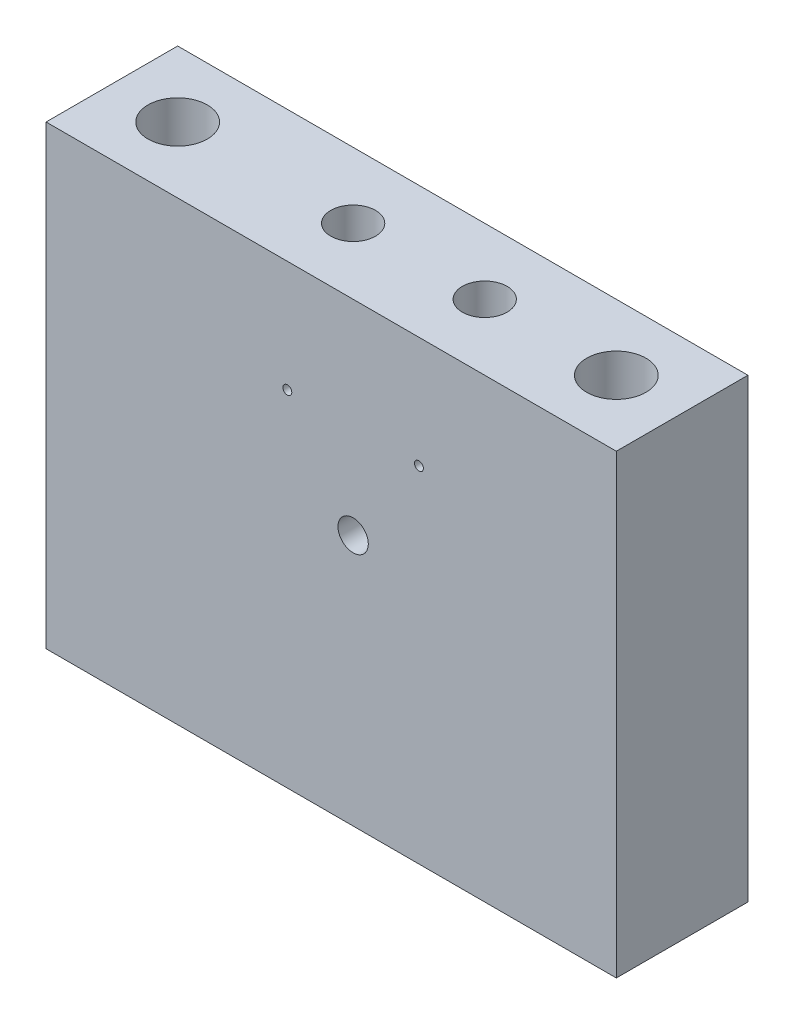
ISO-10303-21;
HEADER;
FILE_DESCRIPTION(('STEP AP214'),'2;1');
FILE_NAME('part.step','',(''),(''),'','','');
FILE_SCHEMA(('AUTOMOTIVE_DESIGN { 1 0 10303 214 1 1 1 1 }'));
ENDSEC;
DATA;
#1=APPLICATION_CONTEXT('core data for automotive mechanical design processes');
#2=APPLICATION_PROTOCOL_DEFINITION('international standard','automotive_design',2000,#1);
#3=PRODUCT_CONTEXT('',#1,'mechanical');
#4=PRODUCT('Part','Part','',(#3));
#5=PRODUCT_RELATED_PRODUCT_CATEGORY('part','',(#4));
#6=PRODUCT_DEFINITION_FORMATION('','',#4);
#7=PRODUCT_DEFINITION_CONTEXT('part definition',#1,'design');
#8=PRODUCT_DEFINITION('design','',#6,#7);
#9=PRODUCT_DEFINITION_SHAPE('','',#8);
#10=(LENGTH_UNIT() NAMED_UNIT(*) SI_UNIT(.MILLI.,.METRE.));
#11=(NAMED_UNIT(*) PLANE_ANGLE_UNIT() SI_UNIT($,.RADIAN.));
#12=(NAMED_UNIT(*) SI_UNIT($,.STERADIAN.) SOLID_ANGLE_UNIT());
#13=UNCERTAINTY_MEASURE_WITH_UNIT(LENGTH_MEASURE(1.E-05),#10,'distance_accuracy_value','');
#14=(GEOMETRIC_REPRESENTATION_CONTEXT(3) GLOBAL_UNCERTAINTY_ASSIGNED_CONTEXT((#13)) GLOBAL_UNIT_ASSIGNED_CONTEXT((#10,
#11,#12)) REPRESENTATION_CONTEXT('',''));
#15=CARTESIAN_POINT('',(0.,0.,0.));
#16=DIRECTION('',(0.,0.,1.));
#17=DIRECTION('',(1.,0.,0.));
#18=AXIS2_PLACEMENT_3D('',#15,#16,#17);
#19=CARTESIAN_POINT('',(32.5,26.,7.50000000000001));
#20=DIRECTION('',(0.,-1.,0.));
#21=DIRECTION('',(0.,0.,-1.));
#22=AXIS2_PLACEMENT_3D('',#19,#20,#21);
#23=PLANE('',#22);
#24=CARTESIAN_POINT('',(25.,26.,0.));
#25=DIRECTION('',(0.,1.,0.));
#26=DIRECTION('',(0.,0.,1.));
#27=AXIS2_PLACEMENT_3D('',#24,#25,#26);
#28=CIRCLE('',#27,3.37819999999999);
#29=CARTESIAN_POINT('',(25.,26.,3.37819999999999));
#30=VERTEX_POINT('',#29);
#31=EDGE_CURVE('E212',#30,#30,#28,.T.);
#32=ORIENTED_EDGE('',*,*,#31,.F.);
#33=EDGE_LOOP('',(#32));
#34=FACE_BOUND('',#33,.T.);
#35=CARTESIAN_POINT('',(-25.,26.,0.));
#36=DIRECTION('',(0.,1.,0.));
#37=DIRECTION('',(0.,0.,1.));
#38=AXIS2_PLACEMENT_3D('',#35,#36,#37);
#39=CIRCLE('',#38,3.37819999999999);
#40=CARTESIAN_POINT('',(-25.,26.,3.37819999999999));
#41=VERTEX_POINT('',#40);
#42=EDGE_CURVE('E92',#41,#41,#39,.T.);
#43=ORIENTED_EDGE('',*,*,#42,.F.);
#44=EDGE_LOOP('',(#43));
#45=FACE_BOUND('',#44,.T.);
#46=CARTESIAN_POINT('',(-5.,26.,0.));
#47=DIRECTION('',(0.,1.,0.));
#48=DIRECTION('',(0.,0.,1.));
#49=AXIS2_PLACEMENT_3D('',#46,#47,#48);
#50=CIRCLE('',#49,2.5527);
#51=CARTESIAN_POINT('',(-5.,26.,2.5527));
#52=VERTEX_POINT('',#51);
#53=EDGE_CURVE('E91',#52,#52,#50,.T.);
#54=ORIENTED_EDGE('',*,*,#53,.F.);
#55=EDGE_LOOP('',(#54));
#56=FACE_BOUND('',#55,.T.);
#57=CARTESIAN_POINT('',(10.,26.,0.));
#58=DIRECTION('',(0.,1.,0.));
#59=DIRECTION('',(0.,0.,1.));
#60=AXIS2_PLACEMENT_3D('',#57,#58,#59);
#61=CIRCLE('',#60,2.5527);
#62=CARTESIAN_POINT('',(10.,26.,2.5527));
#63=VERTEX_POINT('',#62);
#64=EDGE_CURVE('E104',#63,#63,#61,.T.);
#65=ORIENTED_EDGE('',*,*,#64,.F.);
#66=EDGE_LOOP('',(#65));
#67=FACE_BOUND('',#66,.T.);
#68=DIRECTION('',(-1.,0.,0.));
#69=VECTOR('',#68,1.);
#70=CARTESIAN_POINT('',(32.5,26.,-7.50000000000001));
#71=LINE('',#70,#69);
#72=CARTESIAN_POINT('',(32.5,26.,-7.50000000000001));
#73=VERTEX_POINT('',#72);
#74=CARTESIAN_POINT('',(-32.5,26.,-7.50000000000001));
#75=VERTEX_POINT('',#74);
#76=EDGE_CURVE('E107',#73,#75,#71,.T.);
#77=ORIENTED_EDGE('',*,*,#76,.T.);
#78=DIRECTION('',(0.,0.,-1.));
#79=VECTOR('',#78,1.);
#80=CARTESIAN_POINT('',(-32.5,26.,7.50000000000001));
#81=LINE('',#80,#79);
#82=CARTESIAN_POINT('',(-32.5,26.,7.50000000000001));
#83=VERTEX_POINT('',#82);
#84=EDGE_CURVE('E11',#83,#75,#81,.T.);
#85=ORIENTED_EDGE('',*,*,#84,.F.);
#86=DIRECTION('',(-1.,0.,0.));
#87=VECTOR('',#86,1.);
#88=CARTESIAN_POINT('',(32.5,26.,7.50000000000001));
#89=LINE('',#88,#87);
#90=CARTESIAN_POINT('',(32.5,26.,7.50000000000001));
#91=VERTEX_POINT('',#90);
#92=EDGE_CURVE('E116',#91,#83,#89,.T.);
#93=ORIENTED_EDGE('',*,*,#92,.F.);
#94=DIRECTION('',(0.,0.,-1.));
#95=VECTOR('',#94,1.);
#96=CARTESIAN_POINT('',(32.5,26.,7.50000000000001));
#97=LINE('',#96,#95);
#98=EDGE_CURVE('E122',#91,#73,#97,.T.);
#99=ORIENTED_EDGE('',*,*,#98,.T.);
#100=EDGE_LOOP('',(#77,#85,#93,#99));
#101=FACE_BOUND('',#100,.T.);
#102=ADVANCED_FACE('F37',(#34,#45,#56,#67,#101),#23,.F.);
#103=CARTESIAN_POINT('',(-32.4999999999999,-26.,7.50000000000001));
#104=DIRECTION('',(1.,0.,0.));
#105=DIRECTION('',(0.,0.,-1.));
#106=AXIS2_PLACEMENT_3D('',#103,#104,#105);
#107=PLANE('',#106);
#108=DIRECTION('',(0.,-1.,0.));
#109=VECTOR('',#108,1.);
#110=CARTESIAN_POINT('',(-32.4999999999999,-26.,-7.50000000000001));
#111=LINE('',#110,#109);
#112=CARTESIAN_POINT('',(-32.4999999999999,-26.,-7.50000000000001));
#113=VERTEX_POINT('',#112);
#114=EDGE_CURVE('E110',#75,#113,#111,.T.);
#115=ORIENTED_EDGE('',*,*,#114,.T.);
#116=DIRECTION('',(0.,0.,-1.));
#117=VECTOR('',#116,1.);
#118=CARTESIAN_POINT('',(-32.4999999999999,-26.,7.50000000000001));
#119=LINE('',#118,#117);
#120=CARTESIAN_POINT('',(-32.4999999999999,-26.,7.50000000000001));
#121=VERTEX_POINT('',#120);
#122=EDGE_CURVE('E44',#121,#113,#119,.T.);
#123=ORIENTED_EDGE('',*,*,#122,.F.);
#124=DIRECTION('',(0.,-1.,0.));
#125=VECTOR('',#124,1.);
#126=CARTESIAN_POINT('',(-32.4999999999999,-26.,7.50000000000001));
#127=LINE('',#126,#125);
#128=EDGE_CURVE('E118',#83,#121,#127,.T.);
#129=ORIENTED_EDGE('',*,*,#128,.F.);
#130=ORIENTED_EDGE('',*,*,#84,.T.);
#131=EDGE_LOOP('',(#115,#123,#129,#130));
#132=FACE_BOUND('',#131,.T.);
#133=ADVANCED_FACE('F143',(#132),#107,.F.);
#134=CARTESIAN_POINT('',(32.5,-26.,7.50000000000001));
#135=DIRECTION('',(0.,1.,0.));
#136=DIRECTION('',(0.,0.,1.));
#137=AXIS2_PLACEMENT_3D('',#134,#135,#136);
#138=PLANE('',#137);
#139=CARTESIAN_POINT('',(25.,-26.,0.));
#140=DIRECTION('',(0.,1.,0.));
#141=DIRECTION('',(0.,0.,1.));
#142=AXIS2_PLACEMENT_3D('',#139,#140,#141);
#143=CIRCLE('',#142,3.37819999999999);
#144=CARTESIAN_POINT('',(25.,-26.,3.37819999999999));
#145=VERTEX_POINT('',#144);
#146=EDGE_CURVE('E209',#145,#145,#143,.T.);
#147=ORIENTED_EDGE('',*,*,#146,.T.);
#148=EDGE_LOOP('',(#147));
#149=FACE_BOUND('',#148,.T.);
#150=CARTESIAN_POINT('',(-25.,-26.,0.));
#151=DIRECTION('',(0.,1.,0.));
#152=DIRECTION('',(0.,0.,1.));
#153=AXIS2_PLACEMENT_3D('',#150,#151,#152);
#154=CIRCLE('',#153,3.37819999999999);
#155=CARTESIAN_POINT('',(-25.,-26.,3.37819999999999));
#156=VERTEX_POINT('',#155);
#157=EDGE_CURVE('E98',#156,#156,#154,.T.);
#158=ORIENTED_EDGE('',*,*,#157,.T.);
#159=EDGE_LOOP('',(#158));
#160=FACE_BOUND('',#159,.T.);
#161=DIRECTION('',(1.,0.,0.));
#162=VECTOR('',#161,1.);
#163=CARTESIAN_POINT('',(32.5,-26.,-7.50000000000001));
#164=LINE('',#163,#162);
#165=CARTESIAN_POINT('',(32.5,-26.,-7.50000000000001));
#166=VERTEX_POINT('',#165);
#167=EDGE_CURVE('E112',#113,#166,#164,.T.);
#168=ORIENTED_EDGE('',*,*,#167,.T.);
#169=DIRECTION('',(0.,0.,-1.));
#170=VECTOR('',#169,1.);
#171=CARTESIAN_POINT('',(32.5,-26.,7.50000000000001));
#172=LINE('',#171,#170);
#173=CARTESIAN_POINT('',(32.5,-26.,7.50000000000001));
#174=VERTEX_POINT('',#173);
#175=EDGE_CURVE('E125',#174,#166,#172,.T.);
#176=ORIENTED_EDGE('',*,*,#175,.F.);
#177=DIRECTION('',(1.,0.,0.));
#178=VECTOR('',#177,1.);
#179=CARTESIAN_POINT('',(32.5,-26.,7.50000000000001));
#180=LINE('',#179,#178);
#181=EDGE_CURVE('E56',#121,#174,#180,.T.);
#182=ORIENTED_EDGE('',*,*,#181,.F.);
#183=ORIENTED_EDGE('',*,*,#122,.T.);
#184=EDGE_LOOP('',(#168,#176,#182,#183));
#185=FACE_BOUND('',#184,.T.);
#186=ADVANCED_FACE('F131',(#149,#160,#185),#138,.F.);
#187=CARTESIAN_POINT('',(32.5,-26.,7.50000000000001));
#188=DIRECTION('',(-1.,0.,0.));
#189=DIRECTION('',(0.,0.,1.));
#190=AXIS2_PLACEMENT_3D('',#187,#188,#189);
#191=PLANE('',#190);
#192=DIRECTION('',(0.,1.,0.));
#193=VECTOR('',#192,1.);
#194=CARTESIAN_POINT('',(32.5,-26.,-7.50000000000001));
#195=LINE('',#194,#193);
#196=EDGE_CURVE('E114',#166,#73,#195,.T.);
#197=ORIENTED_EDGE('',*,*,#196,.T.);
#198=ORIENTED_EDGE('',*,*,#98,.F.);
#199=DIRECTION('',(0.,1.,0.));
#200=VECTOR('',#199,1.);
#201=CARTESIAN_POINT('',(32.5,-26.,7.50000000000001));
#202=LINE('',#201,#200);
#203=EDGE_CURVE('E51',#174,#91,#202,.T.);
#204=ORIENTED_EDGE('',*,*,#203,.F.);
#205=ORIENTED_EDGE('',*,*,#175,.T.);
#206=EDGE_LOOP('',(#197,#198,#204,#205));
#207=FACE_BOUND('',#206,.T.);
#208=ADVANCED_FACE('F138',(#207),#191,.F.);
#209=CARTESIAN_POINT('',(-32.5,26.,7.50000000000001));
#210=DIRECTION('',(0.,0.,-1.));
#211=DIRECTION('',(-1.,0.,0.));
#212=AXIS2_PLACEMENT_3D('',#209,#210,#211);
#213=PLANE('',#212);
#214=CARTESIAN_POINT('',(-5.,13.3,7.50000000000001));
#215=DIRECTION('',(0.,0.,1.));
#216=DIRECTION('',(1.,0.,0.));
#217=AXIS2_PLACEMENT_3D('',#214,#215,#216);
#218=CIRCLE('',#217,0.508);
#219=CARTESIAN_POINT('',(-4.492,13.3,7.50000000000001));
#220=VERTEX_POINT('',#219);
#221=EDGE_CURVE('E199',#220,#220,#218,.T.);
#222=ORIENTED_EDGE('',*,*,#221,.F.);
#223=EDGE_LOOP('',(#222));
#224=FACE_BOUND('',#223,.T.);
#225=CARTESIAN_POINT('',(9.99999999999999,13.3,7.50000000000001));
#226=DIRECTION('',(0.,0.,1.));
#227=DIRECTION('',(1.,0.,0.));
#228=AXIS2_PLACEMENT_3D('',#225,#226,#227);
#229=CIRCLE('',#228,0.508);
#230=CARTESIAN_POINT('',(10.508,13.3,7.50000000000001));
#231=VERTEX_POINT('',#230);
#232=EDGE_CURVE('E198',#231,#231,#229,.T.);
#233=ORIENTED_EDGE('',*,*,#232,.F.);
#234=EDGE_LOOP('',(#233));
#235=FACE_BOUND('',#234,.T.);
#236=CARTESIAN_POINT('',(2.50000000000001,2.69999999999998,7.50000000000001));
#237=DIRECTION('',(0.,0.,-1.));
#238=DIRECTION('',(-1.,0.,0.));
#239=AXIS2_PLACEMENT_3D('',#236,#237,#238);
#240=CIRCLE('',#239,1.7272);
#241=CARTESIAN_POINT('',(0.772800000000009,2.69999999999998,7.50000000000001));
#242=VERTEX_POINT('',#241);
#243=EDGE_CURVE('E203',#242,#242,#240,.T.);
#244=ORIENTED_EDGE('',*,*,#243,.T.);
#245=EDGE_LOOP('',(#244));
#246=FACE_BOUND('',#245,.T.);
#247=ORIENTED_EDGE('',*,*,#92,.T.);
#248=ORIENTED_EDGE('',*,*,#128,.T.);
#249=ORIENTED_EDGE('',*,*,#181,.T.);
#250=ORIENTED_EDGE('',*,*,#203,.T.);
#251=EDGE_LOOP('',(#247,#248,#249,#250));
#252=FACE_BOUND('',#251,.T.);
#253=ADVANCED_FACE('F142',(#224,#235,#246,#252),#213,.F.);
#254=CARTESIAN_POINT('',(-32.5,26.,-7.50000000000001));
#255=DIRECTION('',(0.,0.,-1.));
#256=DIRECTION('',(-1.,0.,0.));
#257=AXIS2_PLACEMENT_3D('',#254,#255,#256);
#258=PLANE('',#257);
#259=CARTESIAN_POINT('',(2.50000000000001,2.7,-7.50000000000001));
#260=DIRECTION('',(0.,0.,-1.));
#261=DIRECTION('',(-1.,0.,0.));
#262=AXIS2_PLACEMENT_3D('',#259,#260,#261);
#263=CIRCLE('',#262,1.72719999999999);
#264=CARTESIAN_POINT('',(0.772800000000017,2.7,-7.50000000000001));
#265=VERTEX_POINT('',#264);
#266=EDGE_CURVE('E206',#265,#265,#263,.T.);
#267=ORIENTED_EDGE('',*,*,#266,.F.);
#268=EDGE_LOOP('',(#267));
#269=FACE_BOUND('',#268,.T.);
#270=ORIENTED_EDGE('',*,*,#76,.F.);
#271=ORIENTED_EDGE('',*,*,#196,.F.);
#272=ORIENTED_EDGE('',*,*,#167,.F.);
#273=ORIENTED_EDGE('',*,*,#114,.F.);
#274=EDGE_LOOP('',(#270,#271,#272,#273));
#275=FACE_BOUND('',#274,.T.);
#276=ADVANCED_FACE('F136',(#269,#275),#258,.T.);
#277=CARTESIAN_POINT('',(10.,26.,0.));
#278=DIRECTION('',(0.,1.,0.));
#279=DIRECTION('',(0.,0.,1.));
#280=AXIS2_PLACEMENT_3D('',#277,#278,#279);
#281=CYLINDRICAL_SURFACE('',#280,2.5527);
#282=CARTESIAN_POINT('',(10.508,13.3,2.50164211868925));
#283=CARTESIAN_POINT('',(10.5079989530176,13.2717702238329,2.50164267906969));
#284=CARTESIAN_POINT('',(10.5056388977889,13.2435272288031,2.50212515210422));
#285=CARTESIAN_POINT('',(10.4962687781845,13.1878400030869,2.50400011355603));
#286=CARTESIAN_POINT('',(10.4892549747657,13.1603964332203,2.50539333369765));
#287=CARTESIAN_POINT('',(10.4708032834085,13.1071217748594,2.5089258924916));
#288=CARTESIAN_POINT('',(10.4593697728961,13.0812891201685,2.51106449268909));
#289=CARTESIAN_POINT('',(10.4324151740925,13.0319094744302,2.51584596688065));
#290=CARTESIAN_POINT('',(10.4168943213309,13.0083623517878,2.51848881181562));
#291=CARTESIAN_POINT('',(10.381973953277,12.963891200309,2.52402233512416));
#292=CARTESIAN_POINT('',(10.3625281713907,12.9430038313108,2.52691570931868));
#293=CARTESIAN_POINT('',(10.3204099033376,12.9047650964141,2.53260054684003));
#294=CARTESIAN_POINT('',(10.2977371923734,12.8874139770662,2.53539200304991));
#295=CARTESIAN_POINT('',(10.2495660612439,12.8565981688786,2.54058754142937));
#296=CARTESIAN_POINT('',(10.224044953829,12.8431682949505,2.54298807445595));
#297=CARTESIAN_POINT('',(10.1710527550834,12.82080082925,2.54710101717758));
#298=CARTESIAN_POINT('',(10.1435818447258,12.8118628211813,2.54881349063756));
#299=CARTESIAN_POINT('',(10.0878502429101,12.7988468623857,2.55133831997524));
#300=CARTESIAN_POINT('',(10.0596045345752,12.7947070158637,2.55216212967878));
#301=CARTESIAN_POINT('',(10.0028082828865,12.7912118038326,2.55285636199083));
#302=CARTESIAN_POINT('',(9.97425776888728,12.7918559816707,2.55272687559498));
#303=CARTESIAN_POINT('',(9.91808760036911,12.7978635439566,2.55153798681053));
#304=CARTESIAN_POINT('',(9.89046049684028,12.80316025881,2.55049172212096));
#305=CARTESIAN_POINT('',(9.83649523078351,12.8182168182359,2.54760164554639));
#306=CARTESIAN_POINT('',(9.81015711950989,12.827976840124,2.54575780197581));
#307=CARTESIAN_POINT('',(9.75932702568952,12.8517448703033,2.5414580665094));
#308=CARTESIAN_POINT('',(9.73484760733492,12.8657790416731,2.53899842213402));
#309=CARTESIAN_POINT('',(9.68856651478097,12.897677638786,2.5337383033244));
#310=CARTESIAN_POINT('',(9.66676514623332,12.9155425010966,2.53093779005851));
#311=CARTESIAN_POINT('',(9.6260634196296,12.9549612381289,2.52524830949609));
#312=CARTESIAN_POINT('',(9.60721962162856,12.9765734579301,2.52235864976327));
#313=CARTESIAN_POINT('',(9.57341475090448,13.0226803656145,2.51686243379785));
#314=CARTESIAN_POINT('',(9.55845375017027,13.0471751069287,2.51425588281472));
#315=CARTESIAN_POINT('',(9.53281993108517,13.0984324628304,2.50961967714141));
#316=CARTESIAN_POINT('',(9.52215619236394,13.1251997361436,2.50759124657248));
#317=CARTESIAN_POINT('',(9.50549398182397,13.1801957555636,2.50435897045997));
#318=CARTESIAN_POINT('',(9.49949490854747,13.2084243127529,2.50315501861125));
#319=CARTESIAN_POINT('',(9.49241669399007,13.2650291804625,2.50172928989284));
#320=CARTESIAN_POINT('',(9.49125590946148,13.2933948825294,2.50149121625503));
#321=CARTESIAN_POINT('',(9.49366759782454,13.3499146308433,2.50198046613944));
#322=CARTESIAN_POINT('',(9.49723980515025,13.3780686888764,2.50270773549672));
#323=CARTESIAN_POINT('',(9.50894571455685,13.4330920255943,2.5050304718299));
#324=CARTESIAN_POINT('',(9.51703586053722,13.4599709524883,2.50661764443859));
#325=CARTESIAN_POINT('',(9.53750145449165,13.5119918297282,2.51047409004396));
#326=CARTESIAN_POINT('',(9.54987725248474,13.5371336379984,2.5127434187519));
#327=CARTESIAN_POINT('',(9.5787479127634,13.5853240422823,2.51774513327542));
#328=CARTESIAN_POINT('',(9.59529390100952,13.608341416294,2.5204831201568));
#329=CARTESIAN_POINT('',(9.63196704695092,13.6513026979706,2.52609824920598));
#330=CARTESIAN_POINT('',(9.65209456939174,13.6712462922134,2.52897540552512));
#331=CARTESIAN_POINT('',(9.69572579516931,13.7078030662126,2.5345975389888));
#332=CARTESIAN_POINT('',(9.71927612958817,13.7243610680217,2.53733984517944));
#333=CARTESIAN_POINT('',(9.7688716998817,13.753285418631,2.54233696696414));
#334=CARTESIAN_POINT('',(9.7949168315973,13.7656519423297,2.54459180289754));
#335=CARTESIAN_POINT('',(9.84861701352699,13.7857616945684,2.548348514013));
#336=CARTESIAN_POINT('',(9.87626200123963,13.793530967532,2.54985462297054));
#337=CARTESIAN_POINT('',(9.93249756361881,13.8043082459782,2.55196233338833));
#338=CARTESIAN_POINT('',(9.96108802516623,13.8073168189552,2.55256404265618));
#339=CARTESIAN_POINT('',(10.0178757406504,13.8084654983939,2.55279264142016));
#340=CARTESIAN_POINT('',(10.0460712820222,13.8066885937506,2.55243614810555));
#341=CARTESIAN_POINT('',(10.101753416474,13.7984998754009,2.55082330233805));
#342=CARTESIAN_POINT('',(10.1292400182829,13.7920881187905,2.54956696097022));
#343=CARTESIAN_POINT('',(10.18267296273,13.7748484332183,2.54629601333399));
#344=CARTESIAN_POINT('',(10.208622603104,13.764030383096,2.54428310405324));
#345=CARTESIAN_POINT('',(10.2583503593043,13.7382956402495,2.53971585471301));
#346=CARTESIAN_POINT('',(10.2821283054213,13.7233786275721,2.53716147239127));
#347=CARTESIAN_POINT('',(10.3272483020769,13.6895889916707,2.53174072265955));
#348=CARTESIAN_POINT('',(10.3485453389499,13.6706569494704,2.528870020855));
#349=CARTESIAN_POINT('',(10.3876887707738,13.6294968448573,2.52316605345836));
#350=CARTESIAN_POINT('',(10.4055343478509,13.6072680034192,2.5203327968873));
#351=CARTESIAN_POINT('',(10.4374485825551,13.5598614995165,2.51499132225974));
#352=CARTESIAN_POINT('',(10.4514750149003,13.5346549670553,2.51248688508622));
#353=CARTESIAN_POINT('',(10.4750711494224,13.482200172731,2.50813273495516));
#354=CARTESIAN_POINT('',(10.4846449079279,13.4549537955193,2.50628242646496));
#355=CARTESIAN_POINT('',(10.4972001780506,13.4063701841547,2.50381672584816));
#356=CARTESIAN_POINT('',(10.5012428896563,13.3853106613054,2.50300628511824));
#357=CARTESIAN_POINT('',(10.5066431524512,13.3428366216432,2.50191877794106));
#358=CARTESIAN_POINT('',(10.5080007945007,13.3214221168672,2.50164169344553));
#359=CARTESIAN_POINT('',(10.508,13.3,2.50164211868925));
#360=B_SPLINE_CURVE_WITH_KNOTS('',3,(#282,#283,#284,#285,#286,#287,#288,#289,#290,#291,#292,
#293,#294,#295,#296,#297,#298,#299,#300,#301,#302,#303,#304,#305,#306,#307,#308,#309,#310,#311,
#312,#313,#314,#315,#316,#317,#318,#319,#320,#321,#322,#323,#324,#325,#326,#327,#328,#329,#330,
#331,#332,#333,#334,#335,#336,#337,#338,#339,#340,#341,#342,#343,#344,#345,#346,#347,#348,#349,
#350,#351,#352,#353,#354,#355,#356,#357,#358,#359),.UNSPECIFIED.,.T.,.F.,(4,2,2,2,2,2,2,2,2,2,2,
2,2,2,2,2,2,2,2,2,2,2,2,2,2,2,2,2,2,2,2,2,2,2,2,2,2,2,4),(0.,0.0846108954713603,
0.169289853822138,0.253885157301504,0.338475587112579,0.424128450002202,0.509787282649062,
0.59618499819896,0.682574705118247,0.767837134432795,0.853091425238786,0.937143617727637,
1.02119914968083,1.10577991491769,1.19037032459132,1.27642062166422,1.36247251403505,
1.44870528286673,1.53492693107824,1.61968759857524,1.70444351039279,1.78839608090685,
1.87235550963759,1.95739910852253,2.04245137325955,2.12879530627316,2.2151356359535,
2.30098202597154,2.38681818198631,2.47117541020338,2.55553159925739,2.63969969507203,
2.72387436266866,2.80939456571523,2.8949350092599,2.98138598523709,3.06775805047948,
3.13196705512393,3.19617388695636),.UNSPECIFIED.);
#361=CARTESIAN_POINT('',(10.508,13.3,2.50164211868925));
#362=VERTEX_POINT('',#361);
#363=EDGE_CURVE('E192',#362,#362,#360,.T.);
#364=ORIENTED_EDGE('',*,*,#363,.F.);
#365=EDGE_LOOP('',(#364));
#366=FACE_BOUND('',#365,.T.);
#367=CARTESIAN_POINT('',(10.,9.49,0.));
#368=DIRECTION('',(0.,1.,0.));
#369=DIRECTION('',(0.,0.,1.));
#370=AXIS2_PLACEMENT_3D('',#367,#368,#369);
#371=CIRCLE('',#370,2.5527);
#372=CARTESIAN_POINT('',(10.,9.48999999999999,2.5527));
#373=VERTEX_POINT('',#372);
#374=EDGE_CURVE('E95',#373,#373,#371,.T.);
#375=ORIENTED_EDGE('',*,*,#374,.F.);
#376=EDGE_LOOP('',(#375));
#377=FACE_BOUND('',#376,.T.);
#378=ORIENTED_EDGE('',*,*,#64,.T.);
#379=EDGE_LOOP('',(#378));
#380=FACE_BOUND('',#379,.T.);
#381=ADVANCED_FACE('F160',(#366,#377,#380),#281,.F.);
#382=CARTESIAN_POINT('',(10.,9.49,0.));
#383=DIRECTION('',(0.,1.,0.));
#384=DIRECTION('',(0.,0.,1.));
#385=AXIS2_PLACEMENT_3D('',#382,#383,#384);
#386=CONICAL_SURFACE('',#385,2.5527,1.02974425867665);
#387=CARTESIAN_POINT('',(10.,7.95618309780834,0.));
#388=VERTEX_POINT('',#387);
#389=VERTEX_LOOP('',#388);
#390=FACE_BOUND('',#389,.T.);
#391=ORIENTED_EDGE('',*,*,#374,.T.);
#392=EDGE_LOOP('',(#391));
#393=FACE_BOUND('',#392,.T.);
#394=ADVANCED_FACE('F164',(#390,#393),#386,.F.);
#395=CARTESIAN_POINT('',(-5.,26.,0.));
#396=DIRECTION('',(0.,1.,0.));
#397=DIRECTION('',(0.,0.,1.));
#398=AXIS2_PLACEMENT_3D('',#395,#396,#397);
#399=CYLINDRICAL_SURFACE('',#398,2.5527);
#400=CARTESIAN_POINT('',(-4.492,13.3,2.50164211868925));
#401=CARTESIAN_POINT('',(-4.49200104698235,13.2717702238329,2.50164267906969));
#402=CARTESIAN_POINT('',(-4.4943611022111,13.2435272288031,2.50212515210422));
#403=CARTESIAN_POINT('',(-4.50373122181547,13.1878400030869,2.50400011355603));
#404=CARTESIAN_POINT('',(-4.51074502523434,13.1603964332203,2.50539333369765));
#405=CARTESIAN_POINT('',(-4.52919671659147,13.1071217748594,2.5089258924916));
#406=CARTESIAN_POINT('',(-4.54063022710386,13.0812891201685,2.51106449268909));
#407=CARTESIAN_POINT('',(-4.56758482590753,13.0319094744302,2.51584596688065));
#408=CARTESIAN_POINT('',(-4.58310567866909,13.0083623517878,2.51848881181562));
#409=CARTESIAN_POINT('',(-4.61802604672302,12.963891200309,2.52402233512416));
#410=CARTESIAN_POINT('',(-4.63747182860934,12.9430038313108,2.52691570931868));
#411=CARTESIAN_POINT('',(-4.67959009666239,12.9047650964141,2.53260054684003));
#412=CARTESIAN_POINT('',(-4.70226280762662,12.8874139770662,2.53539200304991));
#413=CARTESIAN_POINT('',(-4.75043393875606,12.8565981688786,2.54058754142937));
#414=CARTESIAN_POINT('',(-4.77595504617103,12.8431682949505,2.54298807445595));
#415=CARTESIAN_POINT('',(-4.82894724491655,12.82080082925,2.54710101717758));
#416=CARTESIAN_POINT('',(-4.85641815527419,12.8118628211813,2.54881349063756));
#417=CARTESIAN_POINT('',(-4.91214975708991,12.7988468623857,2.55133831997524));
#418=CARTESIAN_POINT('',(-4.94039546542478,12.7947070158637,2.55216212967878));
#419=CARTESIAN_POINT('',(-4.99719171711349,12.7912118038326,2.55285636199083));
#420=CARTESIAN_POINT('',(-5.02574223111271,12.7918559816707,2.55272687559498));
#421=CARTESIAN_POINT('',(-5.08191239963088,12.7978635439566,2.55153798681053));
#422=CARTESIAN_POINT('',(-5.10953950315972,12.80316025881,2.55049172212096));
#423=CARTESIAN_POINT('',(-5.16350476921649,12.8182168182359,2.54760164554639));
#424=CARTESIAN_POINT('',(-5.18984288049011,12.827976840124,2.54575780197581));
#425=CARTESIAN_POINT('',(-5.24067297431048,12.8517448703033,2.5414580665094));
#426=CARTESIAN_POINT('',(-5.26515239266508,12.8657790416731,2.53899842213402));
#427=CARTESIAN_POINT('',(-5.31143348521902,12.8976776387861,2.5337383033244));
#428=CARTESIAN_POINT('',(-5.33323485376666,12.9155425010967,2.53093779005851));
#429=CARTESIAN_POINT('',(-5.37393658037038,12.9549612381289,2.52524830949609));
#430=CARTESIAN_POINT('',(-5.39278037837143,12.9765734579301,2.52235864976328));
#431=CARTESIAN_POINT('',(-5.42658524909552,13.0226803656145,2.51686243379785));
#432=CARTESIAN_POINT('',(-5.44154624982972,13.0471751069287,2.51425588281472));
#433=CARTESIAN_POINT('',(-5.46718006891483,13.0984324628304,2.50961967714141));
#434=CARTESIAN_POINT('',(-5.47784380763606,13.1251997361436,2.50759124657248));
#435=CARTESIAN_POINT('',(-5.49450601817603,13.1801957555636,2.50435897045998));
#436=CARTESIAN_POINT('',(-5.50050509145253,13.2084243127529,2.50315501861125));
#437=CARTESIAN_POINT('',(-5.50758330600993,13.2650291804625,2.50172928989284));
#438=CARTESIAN_POINT('',(-5.50874409053852,13.2933948825294,2.50149121625503));
#439=CARTESIAN_POINT('',(-5.50633240217546,13.3499146308433,2.50198046613944));
#440=CARTESIAN_POINT('',(-5.50276019484974,13.3780686888764,2.50270773549672));
#441=CARTESIAN_POINT('',(-5.49105428544315,13.4330920255943,2.5050304718299));
#442=CARTESIAN_POINT('',(-5.48296413946277,13.4599709524883,2.50661764443859));
#443=CARTESIAN_POINT('',(-5.46249854550834,13.5119918297282,2.51047409004396));
#444=CARTESIAN_POINT('',(-5.45012274751525,13.5371336379984,2.5127434187519));
#445=CARTESIAN_POINT('',(-5.42125208723659,13.5853240422823,2.51774513327542));
#446=CARTESIAN_POINT('',(-5.40470609899048,13.608341416294,2.5204831201568));
#447=CARTESIAN_POINT('',(-5.36803295304908,13.6513026979706,2.52609824920598));
#448=CARTESIAN_POINT('',(-5.34790543060826,13.6712462922134,2.52897540552512));
#449=CARTESIAN_POINT('',(-5.30427420483069,13.7078030662126,2.5345975389888));
#450=CARTESIAN_POINT('',(-5.28072387041183,13.7243610680217,2.53733984517944));
#451=CARTESIAN_POINT('',(-5.2311283001183,13.753285418631,2.54233696696414));
#452=CARTESIAN_POINT('',(-5.20508316840269,13.7656519423297,2.54459180289754));
#453=CARTESIAN_POINT('',(-5.15138298647301,13.7857616945684,2.548348514013));
#454=CARTESIAN_POINT('',(-5.12373799876037,13.793530967532,2.54985462297055));
#455=CARTESIAN_POINT('',(-5.06750243638119,13.8043082459782,2.55196233338833));
#456=CARTESIAN_POINT('',(-5.03891197483376,13.8073168189552,2.55256404265618));
#457=CARTESIAN_POINT('',(-4.98212425934959,13.8084654983939,2.55279264142016));
#458=CARTESIAN_POINT('',(-4.95392871797776,13.8066885937506,2.55243614810555));
#459=CARTESIAN_POINT('',(-4.898246583526,13.7984998754009,2.55082330233805));
#460=CARTESIAN_POINT('',(-4.87075998171709,13.7920881187905,2.54956696097022));
#461=CARTESIAN_POINT('',(-4.81732703727001,13.7748484332183,2.54629601333399));
#462=CARTESIAN_POINT('',(-4.79137739689598,13.764030383096,2.54428310405324));
#463=CARTESIAN_POINT('',(-4.74164964069574,13.7382956402495,2.53971585471301));
#464=CARTESIAN_POINT('',(-4.71787169457874,13.7233786275721,2.53716147239127));
#465=CARTESIAN_POINT('',(-4.6727516979231,13.6895889916707,2.53174072265955));
#466=CARTESIAN_POINT('',(-4.65145466105008,13.6706569494704,2.528870020855));
#467=CARTESIAN_POINT('',(-4.61231122922617,13.6294968448573,2.52316605345836));
#468=CARTESIAN_POINT('',(-4.59446565214907,13.6072680034192,2.5203327968873));
#469=CARTESIAN_POINT('',(-4.56255141744486,13.5598614995165,2.51499132225974));
#470=CARTESIAN_POINT('',(-4.54852498509973,13.5346549670553,2.51248688508622));
#471=CARTESIAN_POINT('',(-4.52492885057758,13.482200172731,2.50813273495516));
#472=CARTESIAN_POINT('',(-4.51535509207209,13.4549537955193,2.50628242646496));
#473=CARTESIAN_POINT('',(-4.50279982194936,13.4063701841547,2.50381672584816));
#474=CARTESIAN_POINT('',(-4.49875711034367,13.3853106613054,2.50300628511824));
#475=CARTESIAN_POINT('',(-4.49335684754879,13.3428366216432,2.50191877794106));
#476=CARTESIAN_POINT('',(-4.49199920549925,13.3214221168673,2.50164169344553));
#477=CARTESIAN_POINT('',(-4.492,13.3,2.50164211868925));
#478=B_SPLINE_CURVE_WITH_KNOTS('',3,(#400,#401,#402,#403,#404,#405,#406,#407,#408,#409,#410,
#411,#412,#413,#414,#415,#416,#417,#418,#419,#420,#421,#422,#423,#424,#425,#426,#427,#428,#429,
#430,#431,#432,#433,#434,#435,#436,#437,#438,#439,#440,#441,#442,#443,#444,#445,#446,#447,#448,
#449,#450,#451,#452,#453,#454,#455,#456,#457,#458,#459,#460,#461,#462,#463,#464,#465,#466,#467,
#468,#469,#470,#471,#472,#473,#474,#475,#476,#477),.UNSPECIFIED.,.T.,.F.,(4,2,2,2,2,2,2,2,2,2,2,
2,2,2,2,2,2,2,2,2,2,2,2,2,2,2,2,2,2,2,2,2,2,2,2,2,2,2,4),(0.,0.0846108954713621,
0.169289853822138,0.253885157301507,0.338475587112586,0.424128450002206,0.509787282649059,
0.596184998198956,0.682574705118243,0.767837134432791,0.853091425238782,0.937143617727634,
1.02119914968082,1.10577991491768,1.19037032459131,1.27642062166421,1.36247251403505,
1.44870528286672,1.53492693107825,1.61968759857524,1.70444351039279,1.78839608090685,
1.87235550963759,1.95739910852253,2.04245137325955,2.12879530627316,2.2151356359535,
2.30098202597153,2.3868181819863,2.47117541020338,2.55553159925739,2.63969969507203,
2.72387436266866,2.80939456571522,2.89493500925989,2.98138598523708,3.06775805047947,
3.13196705512392,3.19617388695636),.UNSPECIFIED.);
#479=CARTESIAN_POINT('',(-4.492,13.3,2.50164211868925));
#480=VERTEX_POINT('',#479);
#481=EDGE_CURVE('E241',#480,#480,#478,.T.);
#482=ORIENTED_EDGE('',*,*,#481,.F.);
#483=EDGE_LOOP('',(#482));
#484=FACE_BOUND('',#483,.T.);
#485=CARTESIAN_POINT('',(-5.,9.49,0.));
#486=DIRECTION('',(0.,1.,0.));
#487=DIRECTION('',(0.,0.,1.));
#488=AXIS2_PLACEMENT_3D('',#485,#486,#487);
#489=CIRCLE('',#488,2.5527);
#490=CARTESIAN_POINT('',(-5.,9.48999999999999,2.5527));
#491=VERTEX_POINT('',#490);
#492=EDGE_CURVE('E89',#491,#491,#489,.T.);
#493=ORIENTED_EDGE('',*,*,#492,.F.);
#494=EDGE_LOOP('',(#493));
#495=FACE_BOUND('',#494,.T.);
#496=ORIENTED_EDGE('',*,*,#53,.T.);
#497=EDGE_LOOP('',(#496));
#498=FACE_BOUND('',#497,.T.);
#499=ADVANCED_FACE('F85',(#484,#495,#498),#399,.F.);
#500=CARTESIAN_POINT('',(-5.,9.49,0.));
#501=DIRECTION('',(0.,1.,0.));
#502=DIRECTION('',(0.,0.,1.));
#503=AXIS2_PLACEMENT_3D('',#500,#501,#502);
#504=CONICAL_SURFACE('',#503,2.5527,1.02974425867665);
#505=CARTESIAN_POINT('',(-5.,7.95618309780834,0.));
#506=VERTEX_POINT('',#505);
#507=VERTEX_LOOP('',#506);
#508=FACE_BOUND('',#507,.T.);
#509=ORIENTED_EDGE('',*,*,#492,.T.);
#510=EDGE_LOOP('',(#509));
#511=FACE_BOUND('',#510,.T.);
#512=ADVANCED_FACE('F81',(#508,#511),#504,.F.);
#513=CARTESIAN_POINT('',(-25.,26.,0.));
#514=DIRECTION('',(0.,1.,0.));
#515=DIRECTION('',(0.,0.,1.));
#516=AXIS2_PLACEMENT_3D('',#513,#514,#515);
#517=CYLINDRICAL_SURFACE('',#516,3.37819999999999);
#518=ORIENTED_EDGE('',*,*,#157,.F.);
#519=EDGE_LOOP('',(#518));
#520=FACE_BOUND('',#519,.T.);
#521=ORIENTED_EDGE('',*,*,#42,.T.);
#522=EDGE_LOOP('',(#521));
#523=FACE_BOUND('',#522,.T.);
#524=ADVANCED_FACE('F84',(#520,#523),#517,.F.);
#525=CARTESIAN_POINT('',(25.,26.,0.));
#526=DIRECTION('',(0.,1.,0.));
#527=DIRECTION('',(0.,0.,1.));
#528=AXIS2_PLACEMENT_3D('',#525,#526,#527);
#529=CYLINDRICAL_SURFACE('',#528,3.37819999999999);
#530=ORIENTED_EDGE('',*,*,#146,.F.);
#531=EDGE_LOOP('',(#530));
#532=FACE_BOUND('',#531,.T.);
#533=ORIENTED_EDGE('',*,*,#31,.T.);
#534=EDGE_LOOP('',(#533));
#535=FACE_BOUND('',#534,.T.);
#536=ADVANCED_FACE('F174',(#532,#535),#529,.F.);
#537=CARTESIAN_POINT('',(2.50000000000001,2.7,-7.50000000000001));
#538=DIRECTION('',(0.,0.,-1.));
#539=DIRECTION('',(-1.,0.,0.));
#540=AXIS2_PLACEMENT_3D('',#537,#538,#539);
#541=CYLINDRICAL_SURFACE('',#540,1.72719999999999);
#542=ORIENTED_EDGE('',*,*,#243,.F.);
#543=EDGE_LOOP('',(#542));
#544=FACE_BOUND('',#543,.T.);
#545=ORIENTED_EDGE('',*,*,#266,.T.);
#546=EDGE_LOOP('',(#545));
#547=FACE_BOUND('',#546,.T.);
#548=ADVANCED_FACE('F178',(#544,#547),#541,.F.);
#549=CARTESIAN_POINT('',(9.99999999999999,13.3,-7.50099999999998));
#550=DIRECTION('',(0.,0.,1.));
#551=DIRECTION('',(1.,0.,0.));
#552=AXIS2_PLACEMENT_3D('',#549,#550,#551);
#553=CYLINDRICAL_SURFACE('',#552,0.508);
#554=ORIENTED_EDGE('',*,*,#232,.T.);
#555=EDGE_LOOP('',(#554));
#556=FACE_BOUND('',#555,.T.);
#557=ORIENTED_EDGE('',*,*,#363,.T.);
#558=EDGE_LOOP('',(#557));
#559=FACE_BOUND('',#558,.T.);
#560=ADVANCED_FACE('F182',(#556,#559),#553,.F.);
#561=CARTESIAN_POINT('',(-5.,13.3,-7.50099999999998));
#562=DIRECTION('',(0.,0.,1.));
#563=DIRECTION('',(1.,0.,0.));
#564=AXIS2_PLACEMENT_3D('',#561,#562,#563);
#565=CYLINDRICAL_SURFACE('',#564,0.508);
#566=ORIENTED_EDGE('',*,*,#221,.T.);
#567=EDGE_LOOP('',(#566));
#568=FACE_BOUND('',#567,.T.);
#569=ORIENTED_EDGE('',*,*,#481,.T.);
#570=EDGE_LOOP('',(#569));
#571=FACE_BOUND('',#570,.T.);
#572=ADVANCED_FACE('F187',(#568,#571),#565,.F.);
#573=CLOSED_SHELL('',(#102,#133,#186,#208,#253,#276,#381,#394,#499,#512,#524,#536,#548,#560,#572));
#574=MANIFOLD_SOLID_BREP('B2',#573);
#575=ADVANCED_BREP_SHAPE_REPRESENTATION('',(#18,#574),#14);
#576=SHAPE_DEFINITION_REPRESENTATION(#9,#575);
ENDSEC;
END-ISO-10303-21;
